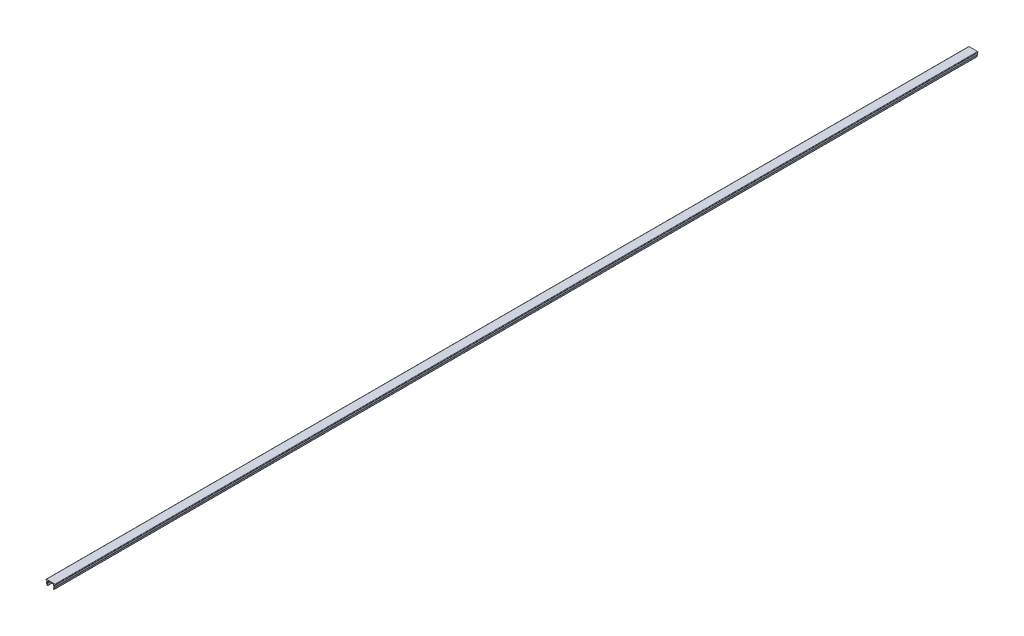
ISO-10303-21;
HEADER;
FILE_DESCRIPTION(('STEP AP214'),'2;1');
FILE_NAME('part.step','',(''),(''),'','','');
FILE_SCHEMA(('AUTOMOTIVE_DESIGN { 1 0 10303 214 1 1 1 1 }'));
ENDSEC;
DATA;
#1=APPLICATION_CONTEXT('core data for automotive mechanical design processes');
#2=APPLICATION_PROTOCOL_DEFINITION('international standard','automotive_design',2000,#1);
#3=PRODUCT_CONTEXT('',#1,'mechanical');
#4=PRODUCT('Part','Part','',(#3));
#5=PRODUCT_RELATED_PRODUCT_CATEGORY('part','',(#4));
#6=PRODUCT_DEFINITION_FORMATION('','',#4);
#7=PRODUCT_DEFINITION_CONTEXT('part definition',#1,'design');
#8=PRODUCT_DEFINITION('design','',#6,#7);
#9=PRODUCT_DEFINITION_SHAPE('','',#8);
#10=(LENGTH_UNIT() NAMED_UNIT(*) SI_UNIT(.MILLI.,.METRE.));
#11=(NAMED_UNIT(*) PLANE_ANGLE_UNIT() SI_UNIT($,.RADIAN.));
#12=(NAMED_UNIT(*) SI_UNIT($,.STERADIAN.) SOLID_ANGLE_UNIT());
#13=UNCERTAINTY_MEASURE_WITH_UNIT(LENGTH_MEASURE(1.E-05),#10,'distance_accuracy_value','');
#14=(GEOMETRIC_REPRESENTATION_CONTEXT(3) GLOBAL_UNCERTAINTY_ASSIGNED_CONTEXT((#13)) GLOBAL_UNIT_ASSIGNED_CONTEXT((#10,
#11,#12)) REPRESENTATION_CONTEXT('',''));
#15=CARTESIAN_POINT('',(0.,0.,0.));
#16=DIRECTION('',(0.,0.,1.));
#17=DIRECTION('',(1.,0.,0.));
#18=AXIS2_PLACEMENT_3D('',#15,#16,#17);
#19=CARTESIAN_POINT('',(-2.20333862518597,4.74999984480356,1000.));
#20=DIRECTION('',(0.,1.,0.));
#21=DIRECTION('',(-1.,0.,0.));
#22=AXIS2_PLACEMENT_3D('',#19,#20,#21);
#23=PLANE('',#22);
#24=DIRECTION('',(1.,0.,0.));
#25=VECTOR('',#24,1.);
#26=CARTESIAN_POINT('',(-2.20333862518597,4.74999984480356,0.));
#27=LINE('',#26,#25);
#28=CARTESIAN_POINT('',(0.197676935958162,4.74999984480356,0.));
#29=VERTEX_POINT('',#28);
#30=CARTESIAN_POINT('',(5.5456458136699,4.74999984480356,0.));
#31=VERTEX_POINT('',#30);
#32=EDGE_CURVE('E203',#29,#31,#27,.T.);
#33=ORIENTED_EDGE('',*,*,#32,.T.);
#34=DIRECTION('',(0.,0.,-1.));
#35=VECTOR('',#34,1.);
#36=CARTESIAN_POINT('',(5.5456458136699,4.74999984480356,1000.));
#37=LINE('',#36,#35);
#38=CARTESIAN_POINT('',(5.5456458136699,4.74999984480356,1000.));
#39=VERTEX_POINT('',#38);
#40=EDGE_CURVE('E245',#31,#39,#37,.F.);
#41=ORIENTED_EDGE('',*,*,#40,.T.);
#42=DIRECTION('',(1.,0.,0.));
#43=VECTOR('',#42,1.);
#44=CARTESIAN_POINT('',(-2.20333862518597,4.74999984480356,1000.));
#45=LINE('',#44,#43);
#46=CARTESIAN_POINT('',(0.197676935958162,4.74999984480356,1000.));
#47=VERTEX_POINT('',#46);
#48=EDGE_CURVE('E232',#47,#39,#45,.T.);
#49=ORIENTED_EDGE('',*,*,#48,.F.);
#50=DIRECTION('',(0.,0.,-1.));
#51=VECTOR('',#50,1.);
#52=CARTESIAN_POINT('',(0.197676935958162,4.74999984480356,1000.));
#53=LINE('',#52,#51);
#54=EDGE_CURVE('E242',#47,#29,#53,.T.);
#55=ORIENTED_EDGE('',*,*,#54,.T.);
#56=EDGE_LOOP('',(#33,#41,#49,#55));
#57=FACE_BOUND('',#56,.T.);
#58=ADVANCED_FACE('F16',(#57),#23,.F.);
#59=CARTESIAN_POINT('',(-1.70333862518597,4.74999984480356,1000.));
#60=VERTEX_POINT('',#59);
#61=CARTESIAN_POINT('',(-1.23365409806573,4.74999984480356,1000.));
#62=VERTEX_POINT('',#61);
#63=EDGE_CURVE('E230',#60,#62,#45,.T.);
#64=ORIENTED_EDGE('',*,*,#63,.F.);
#65=DIRECTION('',(0.,0.,-1.));
#66=VECTOR('',#65,1.);
#67=CARTESIAN_POINT('',(-1.70333862518597,4.74999984480356,0.));
#68=LINE('',#67,#66);
#69=CARTESIAN_POINT('',(-1.70333862518597,4.74999984480356,0.));
#70=VERTEX_POINT('',#69);
#71=EDGE_CURVE('E198',#60,#70,#68,.T.);
#72=ORIENTED_EDGE('',*,*,#71,.T.);
#73=CARTESIAN_POINT('',(-1.23365409806573,4.74999984480356,0.));
#74=VERTEX_POINT('',#73);
#75=EDGE_CURVE('E191',#70,#74,#27,.T.);
#76=ORIENTED_EDGE('',*,*,#75,.T.);
#77=DIRECTION('',(0.,0.,-1.));
#78=VECTOR('',#77,1.);
#79=CARTESIAN_POINT('',(-1.23365409806573,4.74999984480356,1000.));
#80=LINE('',#79,#78);
#81=EDGE_CURVE('E195',#62,#74,#80,.T.);
#82=ORIENTED_EDGE('',*,*,#81,.F.);
#83=EDGE_LOOP('',(#64,#72,#76,#82));
#84=FACE_BOUND('',#83,.T.);
#85=ADVANCED_FACE('F194',(#84),#23,.F.);
#86=CARTESIAN_POINT('',(6.97697684769379,4.74999984480356,0.));
#87=VERTEX_POINT('',#86);
#88=CARTESIAN_POINT('',(7.44666137481403,4.74999984480356,0.));
#89=VERTEX_POINT('',#88);
#90=EDGE_CURVE('E205',#87,#89,#27,.T.);
#91=ORIENTED_EDGE('',*,*,#90,.T.);
#92=DIRECTION('',(0.,0.,-1.));
#93=VECTOR('',#92,1.);
#94=CARTESIAN_POINT('',(7.44666137481403,4.74999984480356,1000.));
#95=LINE('',#94,#93);
#96=CARTESIAN_POINT('',(7.44666137481403,4.74999984480356,1000.));
#97=VERTEX_POINT('',#96);
#98=EDGE_CURVE('E320',#89,#97,#95,.F.);
#99=ORIENTED_EDGE('',*,*,#98,.T.);
#100=CARTESIAN_POINT('',(6.97697684769379,4.74999984480356,1000.));
#101=VERTEX_POINT('',#100);
#102=EDGE_CURVE('E233',#101,#97,#45,.T.);
#103=ORIENTED_EDGE('',*,*,#102,.F.);
#104=DIRECTION('',(0.,0.,-1.));
#105=VECTOR('',#104,1.);
#106=CARTESIAN_POINT('',(6.97697684769379,4.74999984480356,1000.));
#107=LINE('',#106,#105);
#108=EDGE_CURVE('E410',#101,#87,#107,.T.);
#109=ORIENTED_EDGE('',*,*,#108,.T.);
#110=EDGE_LOOP('',(#91,#99,#103,#109));
#111=FACE_BOUND('',#110,.T.);
#112=ADVANCED_FACE('F371',(#111),#23,.F.);
#113=CARTESIAN_POINT('',(-2.20333862518597,5.74999984480356,1000.));
#114=DIRECTION('',(0.,1.,0.));
#115=DIRECTION('',(-1.,0.,0.));
#116=AXIS2_PLACEMENT_3D('',#113,#114,#115);
#117=PLANE('',#116);
#118=DIRECTION('',(1.,0.,0.));
#119=VECTOR('',#118,1.);
#120=CARTESIAN_POINT('',(-2.20333862518597,5.74999984480356,1000.));
#121=LINE('',#120,#119);
#122=CARTESIAN_POINT('',(-1.70333862518597,5.74999984480356,1000.));
#123=VERTEX_POINT('',#122);
#124=CARTESIAN_POINT('',(7.44666137481403,5.74999984480356,1000.));
#125=VERTEX_POINT('',#124);
#126=EDGE_CURVE('E214',#123,#125,#121,.T.);
#127=ORIENTED_EDGE('',*,*,#126,.T.);
#128=DIRECTION('',(0.,0.,-1.));
#129=VECTOR('',#128,1.);
#130=CARTESIAN_POINT('',(7.44666137481403,5.74999984480356,1000.));
#131=LINE('',#130,#129);
#132=CARTESIAN_POINT('',(7.44666137481403,5.74999984480356,0.));
#133=VERTEX_POINT('',#132);
#134=EDGE_CURVE('E317',#125,#133,#131,.T.);
#135=ORIENTED_EDGE('',*,*,#134,.T.);
#136=DIRECTION('',(1.,0.,0.));
#137=VECTOR('',#136,1.);
#138=CARTESIAN_POINT('',(-2.20333862518597,5.74999984480356,0.));
#139=LINE('',#138,#137);
#140=CARTESIAN_POINT('',(-1.70333862518597,5.74999984480356,0.));
#141=VERTEX_POINT('',#140);
#142=EDGE_CURVE('E202',#141,#133,#139,.T.);
#143=ORIENTED_EDGE('',*,*,#142,.F.);
#144=DIRECTION('',(0.,0.,-1.));
#145=VECTOR('',#144,1.);
#146=CARTESIAN_POINT('',(-1.70333862518597,5.74999984480356,1000.));
#147=LINE('',#146,#145);
#148=EDGE_CURVE('E314',#141,#123,#147,.F.);
#149=ORIENTED_EDGE('',*,*,#148,.T.);
#150=EDGE_LOOP('',(#127,#135,#143,#149));
#151=FACE_BOUND('',#150,.T.);
#152=ADVANCED_FACE('F359',(#151),#117,.T.);
#153=CARTESIAN_POINT('',(0.,0.,1000.));
#154=DIRECTION('',(0.,0.,-1.));
#155=DIRECTION('',(-1.,0.,0.));
#156=AXIS2_PLACEMENT_3D('',#153,#154,#155);
#157=PLANE('',#156);
#158=DIRECTION('',(0.230433167257532,-0.973088153985888,0.));
#159=VECTOR('',#158,1.);
#160=CARTESIAN_POINT('',(-1.61488270217891,2.53478326117479,1000.));
#161=LINE('',#160,#159);
#162=CARTESIAN_POINT('',(-1.61488270217891,2.53478326117479,1000.));
#163=VERTEX_POINT('',#162);
#164=CARTESIAN_POINT('',(-1.16176475295702,0.621327338167737,1000.));
#165=VERTEX_POINT('',#164);
#166=EDGE_CURVE('E219',#163,#165,#161,.T.);
#167=ORIENTED_EDGE('',*,*,#166,.T.);
#168=CARTESIAN_POINT('',(-0.67522067596408,0.736543921796503,1000.));
#169=DIRECTION('',(0.,0.,-1.));
#170=DIRECTION('',(-1.,0.,0.));
#171=AXIS2_PLACEMENT_3D('',#168,#169,#170);
#172=CIRCLE('',#171,0.5);
#173=CARTESIAN_POINT('',(-0.560004092335314,0.249999844803559,1000.));
#174=VERTEX_POINT('',#173);
#175=EDGE_CURVE('E294',#165,#174,#172,.F.);
#176=ORIENTED_EDGE('',*,*,#175,.T.);
#177=CARTESIAN_POINT('',(-0.67522067596408,0.736543921796503,1000.));
#178=DIRECTION('',(0.,0.,-1.));
#179=DIRECTION('',(-1.,0.,0.));
#180=AXIS2_PLACEMENT_3D('',#177,#178,#179);
#181=CIRCLE('',#180,0.5);
#182=CARTESIAN_POINT('',(-0.188676598971136,0.851760505425268,1000.));
#183=VERTEX_POINT('',#182);
#184=EDGE_CURVE('E33',#174,#183,#181,.F.);
#185=ORIENTED_EDGE('',*,*,#184,.T.);
#186=DIRECTION('',(0.230433167257532,-0.973088153985888,0.));
#187=VECTOR('',#186,1.);
#188=CARTESIAN_POINT('',(-0.641794548193026,2.76521642843232,1000.));
#189=LINE('',#188,#187);
#190=CARTESIAN_POINT('',(-0.592376915117009,2.5565324359472,1000.));
#191=VERTEX_POINT('',#190);
#192=EDGE_CURVE('E223',#191,#183,#189,.T.);
#193=ORIENTED_EDGE('',*,*,#192,.F.);
#194=CARTESIAN_POINT('',(-0.105832838124066,2.67174901957597,1000.));
#195=DIRECTION('',(0.,0.,-1.));
#196=DIRECTION('',(-1.,0.,0.));
#197=AXIS2_PLACEMENT_3D('',#194,#195,#196);
#198=CIRCLE('',#197,0.5);
#199=CARTESIAN_POINT('',(-0.596836061614389,2.76617271640103,1000.));
#200=VERTEX_POINT('',#199);
#201=EDGE_CURVE('E10',#191,#200,#198,.T.);
#202=ORIENTED_EDGE('',*,*,#201,.T.);
#203=DIRECTION('',(-0.188847393650124,-0.982006446980647,0.));
#204=VECTOR('',#203,1.);
#205=CARTESIAN_POINT('',(-0.137335401695647,5.1555761479785,1000.));
#206=LINE('',#205,#204);
#207=CARTESIAN_POINT('',(-0.293326287532161,4.34442354162862,1000.));
#208=VERTEX_POINT('',#207);
#209=EDGE_CURVE('E414',#208,#200,#206,.T.);
#210=ORIENTED_EDGE('',*,*,#209,.F.);
#211=CARTESIAN_POINT('',(0.197676935958162,4.24999984480356,1000.));
#212=DIRECTION('',(0.,0.,-1.));
#213=DIRECTION('',(-1.,0.,0.));
#214=AXIS2_PLACEMENT_3D('',#211,#212,#213);
#215=CIRCLE('',#214,0.5);
#216=EDGE_CURVE('E329',#208,#47,#215,.T.);
#217=ORIENTED_EDGE('',*,*,#216,.T.);
#218=ORIENTED_EDGE('',*,*,#48,.T.);
#219=CARTESIAN_POINT('',(5.5456458136699,4.24999984480356,1000.));
#220=DIRECTION('',(0.,0.,-1.));
#221=DIRECTION('',(-1.,0.,0.));
#222=AXIS2_PLACEMENT_3D('',#219,#220,#221);
#223=CIRCLE('',#222,0.5);
#224=CARTESIAN_POINT('',(6.03664903716022,4.34442354162862,1000.));
#225=VERTEX_POINT('',#224);
#226=EDGE_CURVE('E325',#39,#225,#223,.T.);
#227=ORIENTED_EDGE('',*,*,#226,.T.);
#228=DIRECTION('',(0.188847393650125,-0.982006446980647,0.));
#229=VECTOR('',#228,1.);
#230=CARTESIAN_POINT('',(5.88065815132371,5.1555761479785,1000.));
#231=LINE('',#230,#229);
#232=CARTESIAN_POINT('',(6.34015881124245,2.76617271640103,1000.));
#233=VERTEX_POINT('',#232);
#234=EDGE_CURVE('E395',#225,#233,#231,.T.);
#235=ORIENTED_EDGE('',*,*,#234,.T.);
#236=CARTESIAN_POINT('',(5.84915558775213,2.67174901957597,1000.));
#237=DIRECTION('',(0.,0.,-1.));
#238=DIRECTION('',(-1.,0.,0.));
#239=AXIS2_PLACEMENT_3D('',#236,#237,#238);
#240=CIRCLE('',#239,0.5);
#241=CARTESIAN_POINT('',(6.33569966474507,2.5565324359472,1000.));
#242=VERTEX_POINT('',#241);
#243=EDGE_CURVE('E333',#233,#242,#240,.T.);
#244=ORIENTED_EDGE('',*,*,#243,.T.);
#245=DIRECTION('',(-0.230433167257532,-0.973088153985888,0.));
#246=VECTOR('',#245,1.);
#247=CARTESIAN_POINT('',(6.38511729782109,2.76521642843233,1000.));
#248=LINE('',#247,#246);
#249=CARTESIAN_POINT('',(5.9319993485992,0.851760505425269,1000.));
#250=VERTEX_POINT('',#249);
#251=EDGE_CURVE('E399',#242,#250,#248,.T.);
#252=ORIENTED_EDGE('',*,*,#251,.T.);
#253=CARTESIAN_POINT('',(6.41854342559214,0.736543921796504,1000.));
#254=DIRECTION('',(0.,0.,-1.));
#255=DIRECTION('',(-1.,0.,0.));
#256=AXIS2_PLACEMENT_3D('',#253,#254,#255);
#257=CIRCLE('',#256,0.5);
#258=CARTESIAN_POINT('',(6.30332684196337,0.24999984480356,1000.));
#259=VERTEX_POINT('',#258);
#260=EDGE_CURVE('E289',#250,#259,#257,.F.);
#261=ORIENTED_EDGE('',*,*,#260,.T.);
#262=CARTESIAN_POINT('',(6.41854342559214,0.736543921796504,1000.));
#263=DIRECTION('',(0.,0.,-1.));
#264=DIRECTION('',(-1.,0.,0.));
#265=AXIS2_PLACEMENT_3D('',#262,#263,#264);
#266=CIRCLE('',#265,0.5);
#267=CARTESIAN_POINT('',(6.90508750258508,0.621327338167738,1000.));
#268=VERTEX_POINT('',#267);
#269=EDGE_CURVE('E291',#259,#268,#266,.F.);
#270=ORIENTED_EDGE('',*,*,#269,.T.);
#271=DIRECTION('',(-0.230433167257532,-0.973088153985888,0.));
#272=VECTOR('',#271,1.);
#273=CARTESIAN_POINT('',(7.35820545180697,2.53478326117479,1000.));
#274=LINE('',#273,#272);
#275=CARTESIAN_POINT('',(7.35820545180697,2.53478326117479,1000.));
#276=VERTEX_POINT('',#275);
#277=EDGE_CURVE('E403',#276,#268,#274,.T.);
#278=ORIENTED_EDGE('',*,*,#277,.F.);
#279=CARTESIAN_POINT('',(6.87166137481403,2.64999984480356,1000.));
#280=DIRECTION('',(0.,0.,-1.));
#281=DIRECTION('',(-1.,0.,0.));
#282=AXIS2_PLACEMENT_3D('',#279,#280,#281);
#283=CIRCLE('',#282,0.5);
#284=CARTESIAN_POINT('',(7.36266459830435,2.74442354162862,1000.));
#285=VERTEX_POINT('',#284);
#286=EDGE_CURVE('E285',#276,#285,#283,.F.);
#287=ORIENTED_EDGE('',*,*,#286,.T.);
#288=DIRECTION('',(0.188847393650125,-0.982006446980647,0.));
#289=VECTOR('',#288,1.);
#290=CARTESIAN_POINT('',(6.86266459830435,5.34442354162862,1000.));
#291=LINE('',#290,#289);
#292=EDGE_CURVE('E375',#101,#285,#291,.T.);
#293=ORIENTED_EDGE('',*,*,#292,.F.);
#294=ORIENTED_EDGE('',*,*,#102,.T.);
#295=CARTESIAN_POINT('',(7.44666137481403,5.24999984480356,1000.));
#296=DIRECTION('',(0.,0.,-1.));
#297=DIRECTION('',(-1.,0.,0.));
#298=AXIS2_PLACEMENT_3D('',#295,#296,#297);
#299=CIRCLE('',#298,0.5);
#300=CARTESIAN_POINT('',(7.94666137481403,5.24999984480356,1000.));
#301=VERTEX_POINT('',#300);
#302=EDGE_CURVE('E281',#97,#301,#299,.F.);
#303=ORIENTED_EDGE('',*,*,#302,.T.);
#304=CARTESIAN_POINT('',(7.44666137481403,5.24999984480356,1000.));
#305=DIRECTION('',(0.,0.,-1.));
#306=DIRECTION('',(-1.,0.,0.));
#307=AXIS2_PLACEMENT_3D('',#304,#305,#306);
#308=CIRCLE('',#307,0.5);
#309=EDGE_CURVE('E283',#301,#125,#308,.F.);
#310=ORIENTED_EDGE('',*,*,#309,.T.);
#311=ORIENTED_EDGE('',*,*,#126,.F.);
#312=CARTESIAN_POINT('',(-1.70333862518597,5.24999984480356,1000.));
#313=DIRECTION('',(0.,0.,-1.));
#314=DIRECTION('',(-1.,0.,0.));
#315=AXIS2_PLACEMENT_3D('',#312,#313,#314);
#316=CIRCLE('',#315,0.5);
#317=CARTESIAN_POINT('',(-2.20333862518597,5.24999984480356,1000.));
#318=VERTEX_POINT('',#317);
#319=EDGE_CURVE('E279',#123,#318,#316,.F.);
#320=ORIENTED_EDGE('',*,*,#319,.T.);
#321=CARTESIAN_POINT('',(-1.70333862518597,5.24999984480356,1000.));
#322=DIRECTION('',(0.,0.,-1.));
#323=DIRECTION('',(-1.,0.,0.));
#324=AXIS2_PLACEMENT_3D('',#321,#322,#323);
#325=CIRCLE('',#324,0.5);
#326=EDGE_CURVE('E277',#318,#60,#325,.F.);
#327=ORIENTED_EDGE('',*,*,#326,.T.);
#328=ORIENTED_EDGE('',*,*,#63,.T.);
#329=DIRECTION('',(-0.188847393650124,-0.982006446980647,0.));
#330=VECTOR('',#329,1.);
#331=CARTESIAN_POINT('',(-1.11934184867629,5.34442354162862,1000.));
#332=LINE('',#331,#330);
#333=CARTESIAN_POINT('',(-1.61934184867629,2.74442354162862,1000.));
#334=VERTEX_POINT('',#333);
#335=EDGE_CURVE('E212',#62,#334,#332,.T.);
#336=ORIENTED_EDGE('',*,*,#335,.T.);
#337=CARTESIAN_POINT('',(-1.12833862518597,2.64999984480356,1000.));
#338=DIRECTION('',(0.,0.,-1.));
#339=DIRECTION('',(-1.,0.,0.));
#340=AXIS2_PLACEMENT_3D('',#337,#338,#339);
#341=CIRCLE('',#340,0.5);
#342=EDGE_CURVE('E287',#334,#163,#341,.F.);
#343=ORIENTED_EDGE('',*,*,#342,.T.);
#344=EDGE_LOOP('',(#167,#176,#185,#193,#202,#210,#217,#218,#227,#235,#244,#252,#261,#270,#278,
#287,#293,#294,#303,#310,#311,#320,#327,#328,#336,#343));
#345=FACE_BOUND('',#344,.T.);
#346=ADVANCED_FACE('F355',(#345),#157,.F.);
#347=CARTESIAN_POINT('',(0.,0.,0.));
#348=DIRECTION('',(0.,0.,-1.));
#349=DIRECTION('',(-1.,0.,0.));
#350=AXIS2_PLACEMENT_3D('',#347,#348,#349);
#351=PLANE('',#350);
#352=CARTESIAN_POINT('',(-0.67522067596408,0.736543921796503,0.));
#353=DIRECTION('',(0.,0.,-1.));
#354=DIRECTION('',(-1.,0.,0.));
#355=AXIS2_PLACEMENT_3D('',#352,#353,#354);
#356=CIRCLE('',#355,0.5);
#357=CARTESIAN_POINT('',(-0.188676598971136,0.851760505425268,0.));
#358=VERTEX_POINT('',#357);
#359=CARTESIAN_POINT('',(-0.560004092335314,0.249999844803559,0.));
#360=VERTEX_POINT('',#359);
#361=EDGE_CURVE('E267',#358,#360,#356,.T.);
#362=ORIENTED_EDGE('',*,*,#361,.T.);
#363=CARTESIAN_POINT('',(-0.67522067596408,0.736543921796503,0.));
#364=DIRECTION('',(0.,0.,-1.));
#365=DIRECTION('',(-1.,0.,0.));
#366=AXIS2_PLACEMENT_3D('',#363,#364,#365);
#367=CIRCLE('',#366,0.5);
#368=CARTESIAN_POINT('',(-1.16176475295702,0.621327338167737,0.));
#369=VERTEX_POINT('',#368);
#370=EDGE_CURVE('E269',#360,#369,#367,.T.);
#371=ORIENTED_EDGE('',*,*,#370,.T.);
#372=DIRECTION('',(0.230433167257532,-0.973088153985888,0.));
#373=VECTOR('',#372,1.);
#374=CARTESIAN_POINT('',(-1.61488270217891,2.53478326117479,0.));
#375=LINE('',#374,#373);
#376=CARTESIAN_POINT('',(-1.61488270217891,2.53478326117479,0.));
#377=VERTEX_POINT('',#376);
#378=EDGE_CURVE('E411',#377,#369,#375,.T.);
#379=ORIENTED_EDGE('',*,*,#378,.F.);
#380=CARTESIAN_POINT('',(-1.12833862518597,2.64999984480356,0.));
#381=DIRECTION('',(0.,0.,-1.));
#382=DIRECTION('',(-1.,0.,0.));
#383=AXIS2_PLACEMENT_3D('',#380,#381,#382);
#384=CIRCLE('',#383,0.5);
#385=CARTESIAN_POINT('',(-1.61934184867629,2.74442354162862,0.));
#386=VERTEX_POINT('',#385);
#387=EDGE_CURVE('E218',#377,#386,#384,.T.);
#388=ORIENTED_EDGE('',*,*,#387,.T.);
#389=DIRECTION('',(-0.188847393650124,-0.982006446980647,0.));
#390=VECTOR('',#389,1.);
#391=CARTESIAN_POINT('',(-1.11934184867629,5.34442354162862,0.));
#392=LINE('',#391,#390);
#393=EDGE_CURVE('E209',#74,#386,#392,.T.);
#394=ORIENTED_EDGE('',*,*,#393,.F.);
#395=ORIENTED_EDGE('',*,*,#75,.F.);
#396=CARTESIAN_POINT('',(-1.70333862518597,5.24999984480356,0.));
#397=DIRECTION('',(0.,0.,-1.));
#398=DIRECTION('',(-1.,0.,0.));
#399=AXIS2_PLACEMENT_3D('',#396,#397,#398);
#400=CIRCLE('',#399,0.5);
#401=CARTESIAN_POINT('',(-2.20333862518597,5.24999984480356,0.));
#402=VERTEX_POINT('',#401);
#403=EDGE_CURVE('E252',#70,#402,#400,.T.);
#404=ORIENTED_EDGE('',*,*,#403,.T.);
#405=CARTESIAN_POINT('',(-1.70333862518597,5.24999984480356,0.));
#406=DIRECTION('',(0.,0.,-1.));
#407=DIRECTION('',(-1.,0.,0.));
#408=AXIS2_PLACEMENT_3D('',#405,#406,#407);
#409=CIRCLE('',#408,0.5);
#410=EDGE_CURVE('E254',#402,#141,#409,.T.);
#411=ORIENTED_EDGE('',*,*,#410,.T.);
#412=ORIENTED_EDGE('',*,*,#142,.T.);
#413=CARTESIAN_POINT('',(7.44666137481403,5.24999984480356,0.));
#414=DIRECTION('',(0.,0.,-1.));
#415=DIRECTION('',(-1.,0.,0.));
#416=AXIS2_PLACEMENT_3D('',#413,#414,#415);
#417=CIRCLE('',#416,0.5);
#418=CARTESIAN_POINT('',(7.94666137481403,5.24999984480356,0.));
#419=VERTEX_POINT('',#418);
#420=EDGE_CURVE('E258',#133,#419,#417,.T.);
#421=ORIENTED_EDGE('',*,*,#420,.T.);
#422=CARTESIAN_POINT('',(7.44666137481403,5.24999984480356,0.));
#423=DIRECTION('',(0.,0.,-1.));
#424=DIRECTION('',(-1.,0.,0.));
#425=AXIS2_PLACEMENT_3D('',#422,#423,#424);
#426=CIRCLE('',#425,0.5);
#427=EDGE_CURVE('E256',#419,#89,#426,.T.);
#428=ORIENTED_EDGE('',*,*,#427,.T.);
#429=ORIENTED_EDGE('',*,*,#90,.F.);
#430=DIRECTION('',(0.188847393650125,-0.982006446980647,0.));
#431=VECTOR('',#430,1.);
#432=CARTESIAN_POINT('',(6.86266459830435,5.34442354162862,0.));
#433=LINE('',#432,#431);
#434=CARTESIAN_POINT('',(7.36266459830435,2.74442354162862,0.));
#435=VERTEX_POINT('',#434);
#436=EDGE_CURVE('E400',#87,#435,#433,.T.);
#437=ORIENTED_EDGE('',*,*,#436,.T.);
#438=CARTESIAN_POINT('',(6.87166137481403,2.64999984480356,0.));
#439=DIRECTION('',(0.,0.,-1.));
#440=DIRECTION('',(-1.,0.,0.));
#441=AXIS2_PLACEMENT_3D('',#438,#439,#440);
#442=CIRCLE('',#441,0.5);
#443=CARTESIAN_POINT('',(7.35820545180697,2.53478326117479,0.));
#444=VERTEX_POINT('',#443);
#445=EDGE_CURVE('E260',#435,#444,#442,.T.);
#446=ORIENTED_EDGE('',*,*,#445,.T.);
#447=DIRECTION('',(-0.230433167257532,-0.973088153985888,0.));
#448=VECTOR('',#447,1.);
#449=CARTESIAN_POINT('',(7.35820545180697,2.53478326117479,0.));
#450=LINE('',#449,#448);
#451=CARTESIAN_POINT('',(6.90508750258508,0.621327338167738,0.));
#452=VERTEX_POINT('',#451);
#453=EDGE_CURVE('E406',#444,#452,#450,.T.);
#454=ORIENTED_EDGE('',*,*,#453,.T.);
#455=CARTESIAN_POINT('',(6.41854342559214,0.736543921796504,0.));
#456=DIRECTION('',(0.,0.,-1.));
#457=DIRECTION('',(-1.,0.,0.));
#458=AXIS2_PLACEMENT_3D('',#455,#456,#457);
#459=CIRCLE('',#458,0.5);
#460=CARTESIAN_POINT('',(6.30332684196337,0.24999984480356,0.));
#461=VERTEX_POINT('',#460);
#462=EDGE_CURVE('E265',#452,#461,#459,.T.);
#463=ORIENTED_EDGE('',*,*,#462,.T.);
#464=CARTESIAN_POINT('',(6.41854342559214,0.736543921796504,0.));
#465=DIRECTION('',(0.,0.,-1.));
#466=DIRECTION('',(-1.,0.,0.));
#467=AXIS2_PLACEMENT_3D('',#464,#465,#466);
#468=CIRCLE('',#467,0.5);
#469=CARTESIAN_POINT('',(5.9319993485992,0.851760505425269,0.));
#470=VERTEX_POINT('',#469);
#471=EDGE_CURVE('E263',#461,#470,#468,.T.);
#472=ORIENTED_EDGE('',*,*,#471,.T.);
#473=DIRECTION('',(-0.230433167257532,-0.973088153985888,0.));
#474=VECTOR('',#473,1.);
#475=CARTESIAN_POINT('',(6.38511729782109,2.76521642843233,0.));
#476=LINE('',#475,#474);
#477=CARTESIAN_POINT('',(6.33569966474507,2.5565324359472,0.));
#478=VERTEX_POINT('',#477);
#479=EDGE_CURVE('E339',#478,#470,#476,.T.);
#480=ORIENTED_EDGE('',*,*,#479,.F.);
#481=CARTESIAN_POINT('',(5.84915558775213,2.67174901957597,0.));
#482=DIRECTION('',(0.,0.,-1.));
#483=DIRECTION('',(-1.,0.,0.));
#484=AXIS2_PLACEMENT_3D('',#481,#482,#483);
#485=CIRCLE('',#484,0.5);
#486=CARTESIAN_POINT('',(6.34015881124245,2.76617271640103,0.));
#487=VERTEX_POINT('',#486);
#488=EDGE_CURVE('E331',#478,#487,#485,.F.);
#489=ORIENTED_EDGE('',*,*,#488,.T.);
#490=DIRECTION('',(0.188847393650125,-0.982006446980647,0.));
#491=VECTOR('',#490,1.);
#492=CARTESIAN_POINT('',(5.88065815132371,5.1555761479785,0.));
#493=LINE('',#492,#491);
#494=CARTESIAN_POINT('',(6.03664903716022,4.34442354162862,0.));
#495=VERTEX_POINT('',#494);
#496=EDGE_CURVE('E393',#495,#487,#493,.T.);
#497=ORIENTED_EDGE('',*,*,#496,.F.);
#498=CARTESIAN_POINT('',(5.5456458136699,4.24999984480356,0.));
#499=DIRECTION('',(0.,0.,-1.));
#500=DIRECTION('',(-1.,0.,0.));
#501=AXIS2_PLACEMENT_3D('',#498,#499,#500);
#502=CIRCLE('',#501,0.5);
#503=EDGE_CURVE('E323',#495,#31,#502,.F.);
#504=ORIENTED_EDGE('',*,*,#503,.T.);
#505=ORIENTED_EDGE('',*,*,#32,.F.);
#506=CARTESIAN_POINT('',(0.197676935958162,4.24999984480356,0.));
#507=DIRECTION('',(0.,0.,-1.));
#508=DIRECTION('',(-1.,0.,0.));
#509=AXIS2_PLACEMENT_3D('',#506,#507,#508);
#510=CIRCLE('',#509,0.5);
#511=CARTESIAN_POINT('',(-0.293326287532161,4.34442354162862,0.));
#512=VERTEX_POINT('',#511);
#513=EDGE_CURVE('E327',#29,#512,#510,.F.);
#514=ORIENTED_EDGE('',*,*,#513,.T.);
#515=DIRECTION('',(-0.188847393650124,-0.982006446980647,0.));
#516=VECTOR('',#515,1.);
#517=CARTESIAN_POINT('',(-0.137335401695647,5.1555761479785,0.));
#518=LINE('',#517,#516);
#519=CARTESIAN_POINT('',(-0.596836061614389,2.76617271640103,0.));
#520=VERTEX_POINT('',#519);
#521=EDGE_CURVE('E220',#512,#520,#518,.T.);
#522=ORIENTED_EDGE('',*,*,#521,.T.);
#523=CARTESIAN_POINT('',(-0.105832838124066,2.67174901957597,0.));
#524=DIRECTION('',(0.,0.,-1.));
#525=DIRECTION('',(-1.,0.,0.));
#526=AXIS2_PLACEMENT_3D('',#523,#524,#525);
#527=CIRCLE('',#526,0.5);
#528=CARTESIAN_POINT('',(-0.592376915117009,2.5565324359472,0.));
#529=VERTEX_POINT('',#528);
#530=EDGE_CURVE('E25',#520,#529,#527,.F.);
#531=ORIENTED_EDGE('',*,*,#530,.T.);
#532=DIRECTION('',(0.230433167257532,-0.973088153985888,0.));
#533=VECTOR('',#532,1.);
#534=CARTESIAN_POINT('',(-0.641794548193026,2.76521642843232,0.));
#535=LINE('',#534,#533);
#536=EDGE_CURVE('E226',#529,#358,#535,.T.);
#537=ORIENTED_EDGE('',*,*,#536,.T.);
#538=EDGE_LOOP('',(#362,#371,#379,#388,#394,#395,#404,#411,#412,#421,#428,#429,#437,#446,#454,
#463,#472,#480,#489,#497,#504,#505,#514,#522,#531,#537));
#539=FACE_BOUND('',#538,.T.);
#540=ADVANCED_FACE('F216',(#539),#351,.T.);
#541=CARTESIAN_POINT('',(-0.137335401695647,5.1555761479785,1000.));
#542=DIRECTION('',(0.982006446980648,-0.188847393650124,0.));
#543=DIRECTION('',(0.188847393650124,0.982006446980647,0.));
#544=AXIS2_PLACEMENT_3D('',#541,#542,#543);
#545=PLANE('',#544);
#546=ORIENTED_EDGE('',*,*,#521,.F.);
#547=DIRECTION('',(0.,0.,-1.));
#548=VECTOR('',#547,1.);
#549=CARTESIAN_POINT('',(-0.293326287532162,4.34442354162862,1000.));
#550=LINE('',#549,#548);
#551=EDGE_CURVE('E250',#512,#208,#550,.F.);
#552=ORIENTED_EDGE('',*,*,#551,.T.);
#553=ORIENTED_EDGE('',*,*,#209,.T.);
#554=DIRECTION('',(0.,0.,-1.));
#555=VECTOR('',#554,1.);
#556=CARTESIAN_POINT('',(-0.59683606161439,2.76617271640103,2.22044604925031E-13));
#557=LINE('',#556,#555);
#558=EDGE_CURVE('E247',#200,#520,#557,.T.);
#559=ORIENTED_EDGE('',*,*,#558,.T.);
#560=EDGE_LOOP('',(#546,#552,#553,#559));
#561=FACE_BOUND('',#560,.T.);
#562=ADVANCED_FACE('F467',(#561),#545,.T.);
#563=CARTESIAN_POINT('',(-1.11934184867629,5.34442354162862,1000.));
#564=DIRECTION('',(0.982006446980648,-0.188847393650124,0.));
#565=DIRECTION('',(0.188847393650124,0.982006446980647,0.));
#566=AXIS2_PLACEMENT_3D('',#563,#564,#565);
#567=PLANE('',#566);
#568=ORIENTED_EDGE('',*,*,#393,.T.);
#569=DIRECTION('',(0.,0.,-1.));
#570=VECTOR('',#569,1.);
#571=CARTESIAN_POINT('',(-1.61934184867629,2.74442354162862,1000.));
#572=LINE('',#571,#570);
#573=EDGE_CURVE('E309',#386,#334,#572,.F.);
#574=ORIENTED_EDGE('',*,*,#573,.T.);
#575=ORIENTED_EDGE('',*,*,#335,.F.);
#576=ORIENTED_EDGE('',*,*,#81,.T.);
#577=EDGE_LOOP('',(#568,#574,#575,#576));
#578=FACE_BOUND('',#577,.T.);
#579=ADVANCED_FACE('F208',(#578),#567,.F.);
#580=CARTESIAN_POINT('',(-1.61488270217891,2.53478326117479,1000.));
#581=DIRECTION('',(0.973088153985888,0.230433167257532,0.));
#582=DIRECTION('',(-0.230433167257532,0.973088153985888,0.));
#583=AXIS2_PLACEMENT_3D('',#580,#581,#582);
#584=PLANE('',#583);
#585=ORIENTED_EDGE('',*,*,#378,.T.);
#586=DIRECTION('',(0.,0.,-1.));
#587=VECTOR('',#586,1.);
#588=CARTESIAN_POINT('',(-1.16176475295702,0.621327338167737,1000.));
#589=LINE('',#588,#587);
#590=EDGE_CURVE('E274',#369,#165,#589,.F.);
#591=ORIENTED_EDGE('',*,*,#590,.T.);
#592=ORIENTED_EDGE('',*,*,#166,.F.);
#593=DIRECTION('',(0.,0.,-1.));
#594=VECTOR('',#593,1.);
#595=CARTESIAN_POINT('',(-1.61488270217891,2.53478326117479,1000.));
#596=LINE('',#595,#594);
#597=EDGE_CURVE('E271',#163,#377,#596,.T.);
#598=ORIENTED_EDGE('',*,*,#597,.T.);
#599=EDGE_LOOP('',(#585,#591,#592,#598));
#600=FACE_BOUND('',#599,.T.);
#601=ADVANCED_FACE('F430',(#600),#584,.F.);
#602=CARTESIAN_POINT('',(-0.641794548193026,2.76521642843232,1000.));
#603=DIRECTION('',(0.973088153985888,0.230433167257532,0.));
#604=DIRECTION('',(-0.230433167257532,0.973088153985888,0.));
#605=AXIS2_PLACEMENT_3D('',#602,#603,#604);
#606=PLANE('',#605);
#607=ORIENTED_EDGE('',*,*,#192,.T.);
#608=DIRECTION('',(0.,0.,-1.));
#609=VECTOR('',#608,1.);
#610=CARTESIAN_POINT('',(-0.188676598971136,0.851760505425268,1000.));
#611=LINE('',#610,#609);
#612=EDGE_CURVE('E297',#183,#358,#611,.T.);
#613=ORIENTED_EDGE('',*,*,#612,.T.);
#614=ORIENTED_EDGE('',*,*,#536,.F.);
#615=DIRECTION('',(0.,0.,-1.));
#616=VECTOR('',#615,1.);
#617=CARTESIAN_POINT('',(-0.59237691511701,2.5565324359472,1000.));
#618=LINE('',#617,#616);
#619=EDGE_CURVE('E40',#529,#191,#618,.F.);
#620=ORIENTED_EDGE('',*,*,#619,.T.);
#621=EDGE_LOOP('',(#607,#613,#614,#620));
#622=FACE_BOUND('',#621,.T.);
#623=ADVANCED_FACE('F471',(#622),#606,.T.);
#624=CARTESIAN_POINT('',(6.86266459830435,5.34442354162862,1000.));
#625=DIRECTION('',(0.982006446980647,0.188847393650125,0.));
#626=DIRECTION('',(-0.188847393650125,0.982006446980647,0.));
#627=AXIS2_PLACEMENT_3D('',#624,#625,#626);
#628=PLANE('',#627);
#629=ORIENTED_EDGE('',*,*,#292,.T.);
#630=DIRECTION('',(0.,0.,-1.));
#631=VECTOR('',#630,1.);
#632=CARTESIAN_POINT('',(7.36266459830435,2.74442354162862,1000.));
#633=LINE('',#632,#631);
#634=EDGE_CURVE('E311',#285,#435,#633,.T.);
#635=ORIENTED_EDGE('',*,*,#634,.T.);
#636=ORIENTED_EDGE('',*,*,#436,.F.);
#637=ORIENTED_EDGE('',*,*,#108,.F.);
#638=EDGE_LOOP('',(#629,#635,#636,#637));
#639=FACE_BOUND('',#638,.T.);
#640=ADVANCED_FACE('F474',(#639),#628,.T.);
#641=CARTESIAN_POINT('',(5.88065815132371,5.1555761479785,1000.));
#642=DIRECTION('',(0.982006446980647,0.188847393650125,0.));
#643=DIRECTION('',(-0.188847393650125,0.982006446980647,0.));
#644=AXIS2_PLACEMENT_3D('',#641,#642,#643);
#645=PLANE('',#644);
#646=ORIENTED_EDGE('',*,*,#234,.F.);
#647=DIRECTION('',(0.,0.,-1.));
#648=VECTOR('',#647,1.);
#649=CARTESIAN_POINT('',(6.03664903716022,4.34442354162862,0.));
#650=LINE('',#649,#648);
#651=EDGE_CURVE('E239',#225,#495,#650,.T.);
#652=ORIENTED_EDGE('',*,*,#651,.T.);
#653=ORIENTED_EDGE('',*,*,#496,.T.);
#654=DIRECTION('',(0.,0.,-1.));
#655=VECTOR('',#654,1.);
#656=CARTESIAN_POINT('',(6.34015881124245,2.76617271640103,1000.));
#657=LINE('',#656,#655);
#658=EDGE_CURVE('E213',#487,#233,#657,.F.);
#659=ORIENTED_EDGE('',*,*,#658,.T.);
#660=EDGE_LOOP('',(#646,#652,#653,#659));
#661=FACE_BOUND('',#660,.T.);
#662=ADVANCED_FACE('F392',(#661),#645,.F.);
#663=CARTESIAN_POINT('',(6.38511729782109,2.76521642843233,1000.));
#664=DIRECTION('',(0.973088153985888,-0.230433167257532,0.));
#665=DIRECTION('',(0.230433167257532,0.973088153985888,0.));
#666=AXIS2_PLACEMENT_3D('',#663,#664,#665);
#667=PLANE('',#666);
#668=ORIENTED_EDGE('',*,*,#479,.T.);
#669=DIRECTION('',(0.,0.,-1.));
#670=VECTOR('',#669,1.);
#671=CARTESIAN_POINT('',(5.9319993485992,0.851760505425269,1000.));
#672=LINE('',#671,#670);
#673=EDGE_CURVE('E307',#470,#250,#672,.F.);
#674=ORIENTED_EDGE('',*,*,#673,.T.);
#675=ORIENTED_EDGE('',*,*,#251,.F.);
#676=DIRECTION('',(0.,0.,-1.));
#677=VECTOR('',#676,1.);
#678=CARTESIAN_POINT('',(6.33569966474507,2.5565324359472,0.));
#679=LINE('',#678,#677);
#680=EDGE_CURVE('E304',#242,#478,#679,.T.);
#681=ORIENTED_EDGE('',*,*,#680,.T.);
#682=EDGE_LOOP('',(#668,#674,#675,#681));
#683=FACE_BOUND('',#682,.T.);
#684=ADVANCED_FACE('F480',(#683),#667,.F.);
#685=CARTESIAN_POINT('',(7.35820545180697,2.53478326117479,1000.));
#686=DIRECTION('',(0.973088153985888,-0.230433167257532,0.));
#687=DIRECTION('',(0.230433167257532,0.973088153985888,0.));
#688=AXIS2_PLACEMENT_3D('',#685,#686,#687);
#689=PLANE('',#688);
#690=ORIENTED_EDGE('',*,*,#277,.T.);
#691=DIRECTION('',(0.,0.,-1.));
#692=VECTOR('',#691,1.);
#693=CARTESIAN_POINT('',(6.90508750258508,0.621327338167738,1000.));
#694=LINE('',#693,#692);
#695=EDGE_CURVE('E301',#268,#452,#694,.T.);
#696=ORIENTED_EDGE('',*,*,#695,.T.);
#697=ORIENTED_EDGE('',*,*,#453,.F.);
#698=DIRECTION('',(0.,0.,-1.));
#699=VECTOR('',#698,1.);
#700=CARTESIAN_POINT('',(7.35820545180697,2.53478326117479,1000.));
#701=LINE('',#700,#699);
#702=EDGE_CURVE('E299',#444,#276,#701,.F.);
#703=ORIENTED_EDGE('',*,*,#702,.T.);
#704=EDGE_LOOP('',(#690,#696,#697,#703));
#705=FACE_BOUND('',#704,.T.);
#706=ADVANCED_FACE('F483',(#705),#689,.T.);
#707=CARTESIAN_POINT('',(5.5456458136699,4.24999984480356,1000.));
#708=DIRECTION('',(0.,0.,1.));
#709=DIRECTION('',(1.,0.,0.));
#710=AXIS2_PLACEMENT_3D('',#707,#708,#709);
#711=CYLINDRICAL_SURFACE('',#710,0.5);
#712=ORIENTED_EDGE('',*,*,#226,.F.);
#713=ORIENTED_EDGE('',*,*,#40,.F.);
#714=ORIENTED_EDGE('',*,*,#503,.F.);
#715=ORIENTED_EDGE('',*,*,#651,.F.);
#716=EDGE_LOOP('',(#712,#713,#714,#715));
#717=FACE_BOUND('',#716,.T.);
#718=ADVANCED_FACE('F388',(#717),#711,.F.);
#719=CARTESIAN_POINT('',(0.197676935958162,4.24999984480356,1000.));
#720=DIRECTION('',(0.,0.,-1.));
#721=DIRECTION('',(-1.,0.,0.));
#722=AXIS2_PLACEMENT_3D('',#719,#720,#721);
#723=CYLINDRICAL_SURFACE('',#722,0.5);
#724=ORIENTED_EDGE('',*,*,#216,.F.);
#725=ORIENTED_EDGE('',*,*,#551,.F.);
#726=ORIENTED_EDGE('',*,*,#513,.F.);
#727=ORIENTED_EDGE('',*,*,#54,.F.);
#728=EDGE_LOOP('',(#724,#725,#726,#727));
#729=FACE_BOUND('',#728,.T.);
#730=ADVANCED_FACE('F515',(#729),#723,.F.);
#731=CARTESIAN_POINT('',(-0.67522067596408,0.736543921796503,1000.));
#732=DIRECTION('',(0.,0.,-1.));
#733=DIRECTION('',(-1.,0.,0.));
#734=AXIS2_PLACEMENT_3D('',#731,#732,#733);
#735=CYLINDRICAL_SURFACE('',#734,0.5);
#736=ORIENTED_EDGE('',*,*,#612,.F.);
#737=ORIENTED_EDGE('',*,*,#184,.F.);
#738=DIRECTION('',(0.,0.,-1.));
#739=VECTOR('',#738,1.);
#740=CARTESIAN_POINT('',(-0.560004092335314,0.249999844803559,1000.));
#741=LINE('',#740,#739);
#742=EDGE_CURVE('E336',#360,#174,#741,.F.);
#743=ORIENTED_EDGE('',*,*,#742,.F.);
#744=ORIENTED_EDGE('',*,*,#361,.F.);
#745=EDGE_LOOP('',(#736,#737,#743,#744));
#746=FACE_BOUND('',#745,.T.);
#747=ADVANCED_FACE('F424',(#746),#735,.T.);
#748=CARTESIAN_POINT('',(-0.67522067596408,0.736543921796503,1000.));
#749=DIRECTION('',(0.,0.,1.));
#750=DIRECTION('',(1.,0.,0.));
#751=AXIS2_PLACEMENT_3D('',#748,#749,#750);
#752=CYLINDRICAL_SURFACE('',#751,0.5);
#753=ORIENTED_EDGE('',*,*,#175,.F.);
#754=ORIENTED_EDGE('',*,*,#590,.F.);
#755=ORIENTED_EDGE('',*,*,#370,.F.);
#756=ORIENTED_EDGE('',*,*,#742,.T.);
#757=EDGE_LOOP('',(#753,#754,#755,#756));
#758=FACE_BOUND('',#757,.T.);
#759=ADVANCED_FACE('F428',(#758),#752,.T.);
#760=CARTESIAN_POINT('',(6.41854342559214,0.736543921796504,1000.));
#761=DIRECTION('',(0.,0.,1.));
#762=DIRECTION('',(1.,0.,0.));
#763=AXIS2_PLACEMENT_3D('',#760,#761,#762);
#764=CYLINDRICAL_SURFACE('',#763,0.5);
#765=DIRECTION('',(0.,0.,-1.));
#766=VECTOR('',#765,1.);
#767=CARTESIAN_POINT('',(6.30332684196337,0.249999844803559,0.));
#768=LINE('',#767,#766);
#769=EDGE_CURVE('E340',#259,#461,#768,.T.);
#770=ORIENTED_EDGE('',*,*,#769,.F.);
#771=ORIENTED_EDGE('',*,*,#260,.F.);
#772=ORIENTED_EDGE('',*,*,#673,.F.);
#773=ORIENTED_EDGE('',*,*,#471,.F.);
#774=EDGE_LOOP('',(#770,#771,#772,#773));
#775=FACE_BOUND('',#774,.T.);
#776=ADVANCED_FACE('F537',(#775),#764,.T.);
#777=CARTESIAN_POINT('',(6.41854342559214,0.736543921796504,1000.));
#778=DIRECTION('',(0.,0.,-1.));
#779=DIRECTION('',(-1.,0.,0.));
#780=AXIS2_PLACEMENT_3D('',#777,#778,#779);
#781=CYLINDRICAL_SURFACE('',#780,0.5);
#782=ORIENTED_EDGE('',*,*,#269,.F.);
#783=ORIENTED_EDGE('',*,*,#769,.T.);
#784=ORIENTED_EDGE('',*,*,#462,.F.);
#785=ORIENTED_EDGE('',*,*,#695,.F.);
#786=EDGE_LOOP('',(#782,#783,#784,#785));
#787=FACE_BOUND('',#786,.T.);
#788=ADVANCED_FACE('F545',(#787),#781,.T.);
#789=CARTESIAN_POINT('',(5.84915558775213,2.67174901957597,1000.));
#790=DIRECTION('',(0.,0.,1.));
#791=DIRECTION('',(1.,0.,0.));
#792=AXIS2_PLACEMENT_3D('',#789,#790,#791);
#793=CYLINDRICAL_SURFACE('',#792,0.5);
#794=ORIENTED_EDGE('',*,*,#243,.F.);
#795=ORIENTED_EDGE('',*,*,#658,.F.);
#796=ORIENTED_EDGE('',*,*,#488,.F.);
#797=ORIENTED_EDGE('',*,*,#680,.F.);
#798=EDGE_LOOP('',(#794,#795,#796,#797));
#799=FACE_BOUND('',#798,.T.);
#800=ADVANCED_FACE('F447',(#799),#793,.F.);
#801=CARTESIAN_POINT('',(-0.105832838124066,2.67174901957597,1000.));
#802=DIRECTION('',(0.,0.,1.));
#803=DIRECTION('',(1.,0.,0.));
#804=AXIS2_PLACEMENT_3D('',#801,#802,#803);
#805=CYLINDRICAL_SURFACE('',#804,0.5);
#806=ORIENTED_EDGE('',*,*,#201,.F.);
#807=ORIENTED_EDGE('',*,*,#619,.F.);
#808=ORIENTED_EDGE('',*,*,#530,.F.);
#809=ORIENTED_EDGE('',*,*,#558,.F.);
#810=EDGE_LOOP('',(#806,#807,#808,#809));
#811=FACE_BOUND('',#810,.T.);
#812=ADVANCED_FACE('F438',(#811),#805,.F.);
#813=CARTESIAN_POINT('',(-1.12833862518597,2.64999984480356,1000.));
#814=DIRECTION('',(0.,0.,-1.));
#815=DIRECTION('',(-1.,0.,0.));
#816=AXIS2_PLACEMENT_3D('',#813,#814,#815);
#817=CYLINDRICAL_SURFACE('',#816,0.5);
#818=ORIENTED_EDGE('',*,*,#342,.F.);
#819=ORIENTED_EDGE('',*,*,#573,.F.);
#820=ORIENTED_EDGE('',*,*,#387,.F.);
#821=ORIENTED_EDGE('',*,*,#597,.F.);
#822=EDGE_LOOP('',(#818,#819,#820,#821));
#823=FACE_BOUND('',#822,.T.);
#824=ADVANCED_FACE('F435',(#823),#817,.T.);
#825=CARTESIAN_POINT('',(6.87166137481403,2.64999984480356,1000.));
#826=DIRECTION('',(0.,0.,-1.));
#827=DIRECTION('',(-1.,0.,0.));
#828=AXIS2_PLACEMENT_3D('',#825,#826,#827);
#829=CYLINDRICAL_SURFACE('',#828,0.5);
#830=ORIENTED_EDGE('',*,*,#286,.F.);
#831=ORIENTED_EDGE('',*,*,#702,.F.);
#832=ORIENTED_EDGE('',*,*,#445,.F.);
#833=ORIENTED_EDGE('',*,*,#634,.F.);
#834=EDGE_LOOP('',(#830,#831,#832,#833));
#835=FACE_BOUND('',#834,.T.);
#836=ADVANCED_FACE('F437',(#835),#829,.T.);
#837=CARTESIAN_POINT('',(7.44666137481403,5.24999984480356,1000.));
#838=DIRECTION('',(0.,0.,1.));
#839=DIRECTION('',(1.,0.,0.));
#840=AXIS2_PLACEMENT_3D('',#837,#838,#839);
#841=CYLINDRICAL_SURFACE('',#840,0.5);
#842=DIRECTION('',(0.,0.,-1.));
#843=VECTOR('',#842,1.);
#844=CARTESIAN_POINT('',(7.94666137481403,5.24999984480356,0.));
#845=LINE('',#844,#843);
#846=EDGE_CURVE('E342',#301,#419,#845,.T.);
#847=ORIENTED_EDGE('',*,*,#846,.F.);
#848=ORIENTED_EDGE('',*,*,#302,.F.);
#849=ORIENTED_EDGE('',*,*,#98,.F.);
#850=ORIENTED_EDGE('',*,*,#427,.F.);
#851=EDGE_LOOP('',(#847,#848,#849,#850));
#852=FACE_BOUND('',#851,.T.);
#853=ADVANCED_FACE('F367',(#852),#841,.T.);
#854=CARTESIAN_POINT('',(7.44666137481403,5.24999984480356,1000.));
#855=DIRECTION('',(0.,0.,-1.));
#856=DIRECTION('',(-1.,0.,0.));
#857=AXIS2_PLACEMENT_3D('',#854,#855,#856);
#858=CYLINDRICAL_SURFACE('',#857,0.5);
#859=ORIENTED_EDGE('',*,*,#309,.F.);
#860=ORIENTED_EDGE('',*,*,#846,.T.);
#861=ORIENTED_EDGE('',*,*,#420,.F.);
#862=ORIENTED_EDGE('',*,*,#134,.F.);
#863=EDGE_LOOP('',(#859,#860,#861,#862));
#864=FACE_BOUND('',#863,.T.);
#865=ADVANCED_FACE('F361',(#864),#858,.T.);
#866=CARTESIAN_POINT('',(-1.70333862518597,5.24999984480356,1000.));
#867=DIRECTION('',(0.,0.,1.));
#868=DIRECTION('',(1.,0.,0.));
#869=AXIS2_PLACEMENT_3D('',#866,#867,#868);
#870=CYLINDRICAL_SURFACE('',#869,0.5);
#871=ORIENTED_EDGE('',*,*,#71,.F.);
#872=ORIENTED_EDGE('',*,*,#326,.F.);
#873=DIRECTION('',(0.,0.,-1.));
#874=VECTOR('',#873,1.);
#875=CARTESIAN_POINT('',(-2.20333862518597,5.24999984480356,1000.));
#876=LINE('',#875,#874);
#877=EDGE_CURVE('E20',#402,#318,#876,.F.);
#878=ORIENTED_EDGE('',*,*,#877,.F.);
#879=ORIENTED_EDGE('',*,*,#403,.F.);
#880=EDGE_LOOP('',(#871,#872,#878,#879));
#881=FACE_BOUND('',#880,.T.);
#882=ADVANCED_FACE('F18',(#881),#870,.T.);
#883=CARTESIAN_POINT('',(-1.70333862518597,5.24999984480356,1000.));
#884=DIRECTION('',(0.,0.,-1.));
#885=DIRECTION('',(-1.,0.,0.));
#886=AXIS2_PLACEMENT_3D('',#883,#884,#885);
#887=CYLINDRICAL_SURFACE('',#886,0.5);
#888=ORIENTED_EDGE('',*,*,#319,.F.);
#889=ORIENTED_EDGE('',*,*,#148,.F.);
#890=ORIENTED_EDGE('',*,*,#410,.F.);
#891=ORIENTED_EDGE('',*,*,#877,.T.);
#892=EDGE_LOOP('',(#888,#889,#890,#891));
#893=FACE_BOUND('',#892,.T.);
#894=ADVANCED_FACE('F351',(#893),#887,.T.);
#895=CLOSED_SHELL('',(#58,#85,#112,#152,#346,#540,#562,#579,#601,#623,#640,#662,#684,#706,#718,
#730,#747,#759,#776,#788,#800,#812,#824,#836,#853,#865,#882,#894));
#896=MANIFOLD_SOLID_BREP('B1',#895);
#897=ADVANCED_BREP_SHAPE_REPRESENTATION('',(#18,#896),#14);
#898=SHAPE_DEFINITION_REPRESENTATION(#9,#897);
ENDSEC;
END-ISO-10303-21;
